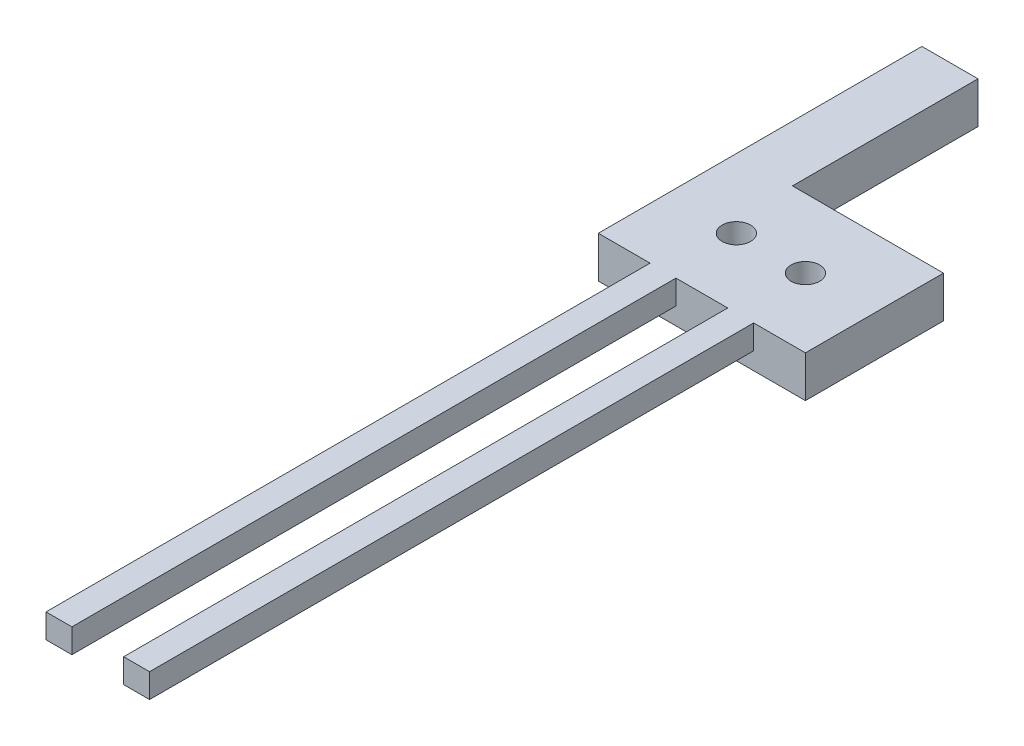
ISO-10303-21;
HEADER;
FILE_DESCRIPTION(('STEP AP214'),'2;1');
FILE_NAME('part.step','',(''),(''),'','','');
FILE_SCHEMA(('AUTOMOTIVE_DESIGN { 1 0 10303 214 1 1 1 1 }'));
ENDSEC;
DATA;
#1=APPLICATION_CONTEXT('core data for automotive mechanical design processes');
#2=APPLICATION_PROTOCOL_DEFINITION('international standard','automotive_design',2000,#1);
#3=PRODUCT_CONTEXT('',#1,'mechanical');
#4=PRODUCT('Part','Part','',(#3));
#5=PRODUCT_RELATED_PRODUCT_CATEGORY('part','',(#4));
#6=PRODUCT_DEFINITION_FORMATION('','',#4);
#7=PRODUCT_DEFINITION_CONTEXT('part definition',#1,'design');
#8=PRODUCT_DEFINITION('design','',#6,#7);
#9=PRODUCT_DEFINITION_SHAPE('','',#8);
#10=(LENGTH_UNIT() NAMED_UNIT(*) SI_UNIT(.MILLI.,.METRE.));
#11=(NAMED_UNIT(*) PLANE_ANGLE_UNIT() SI_UNIT($,.RADIAN.));
#12=(NAMED_UNIT(*) SI_UNIT($,.STERADIAN.) SOLID_ANGLE_UNIT());
#13=UNCERTAINTY_MEASURE_WITH_UNIT(LENGTH_MEASURE(1.E-05),#10,'distance_accuracy_value','');
#14=(GEOMETRIC_REPRESENTATION_CONTEXT(3) GLOBAL_UNCERTAINTY_ASSIGNED_CONTEXT((#13)) GLOBAL_UNIT_ASSIGNED_CONTEXT((#10,
#11,#12)) REPRESENTATION_CONTEXT('',''));
#15=CARTESIAN_POINT('',(0.,0.,0.));
#16=DIRECTION('',(0.,0.,1.));
#17=DIRECTION('',(1.,0.,0.));
#18=AXIS2_PLACEMENT_3D('',#15,#16,#17);
#19=CARTESIAN_POINT('',(0.,-4.8,0.));
#20=DIRECTION('',(0.,0.,-1.));
#21=DIRECTION('',(-1.,0.,0.));
#22=AXIS2_PLACEMENT_3D('',#19,#20,#21);
#23=PLANE('',#22);
#24=DIRECTION('',(0.,-1.,0.));
#25=VECTOR('',#24,1.);
#26=CARTESIAN_POINT('',(15.,0.,0.));
#27=LINE('',#26,#25);
#28=CARTESIAN_POINT('',(15.,0.,0.));
#29=VERTEX_POINT('',#28);
#30=CARTESIAN_POINT('',(15.,-2.8,0.));
#31=VERTEX_POINT('',#30);
#32=EDGE_CURVE('E206',#29,#31,#27,.T.);
#33=ORIENTED_EDGE('',*,*,#32,.F.);
#34=DIRECTION('',(-1.,0.,0.));
#35=VECTOR('',#34,1.);
#36=CARTESIAN_POINT('',(0.,0.,0.));
#37=LINE('',#36,#35);
#38=CARTESIAN_POINT('',(9.,0.,0.));
#39=VERTEX_POINT('',#38);
#40=EDGE_CURVE('E303',#29,#39,#37,.T.);
#41=ORIENTED_EDGE('',*,*,#40,.T.);
#42=DIRECTION('',(0.,1.,0.));
#43=VECTOR('',#42,1.);
#44=CARTESIAN_POINT('',(9.,0.,0.));
#45=LINE('',#44,#43);
#46=CARTESIAN_POINT('',(9.,-2.8,0.));
#47=VERTEX_POINT('',#46);
#48=EDGE_CURVE('E227',#47,#39,#45,.T.);
#49=ORIENTED_EDGE('',*,*,#48,.F.);
#50=DIRECTION('',(1.,0.,0.));
#51=VECTOR('',#50,1.);
#52=CARTESIAN_POINT('',(6.,-2.8,0.));
#53=LINE('',#52,#51);
#54=CARTESIAN_POINT('',(6.,-2.8,0.));
#55=VERTEX_POINT('',#54);
#56=EDGE_CURVE('E240',#55,#47,#53,.T.);
#57=ORIENTED_EDGE('',*,*,#56,.F.);
#58=DIRECTION('',(0.,-1.,0.));
#59=VECTOR('',#58,1.);
#60=CARTESIAN_POINT('',(6.,0.,0.));
#61=LINE('',#60,#59);
#62=CARTESIAN_POINT('',(6.,0.,0.));
#63=VERTEX_POINT('',#62);
#64=EDGE_CURVE('E210',#63,#55,#61,.T.);
#65=ORIENTED_EDGE('',*,*,#64,.F.);
#66=CARTESIAN_POINT('',(0.,0.,0.));
#67=VERTEX_POINT('',#66);
#68=EDGE_CURVE('E300',#63,#67,#37,.T.);
#69=ORIENTED_EDGE('',*,*,#68,.T.);
#70=DIRECTION('',(0.,1.,0.));
#71=VECTOR('',#70,1.);
#72=CARTESIAN_POINT('',(0.,-4.8,0.));
#73=LINE('',#72,#71);
#74=CARTESIAN_POINT('',(0.,-4.8,0.));
#75=VERTEX_POINT('',#74);
#76=EDGE_CURVE('E291',#75,#67,#73,.T.);
#77=ORIENTED_EDGE('',*,*,#76,.F.);
#78=DIRECTION('',(-1.,0.,0.));
#79=VECTOR('',#78,1.);
#80=CARTESIAN_POINT('',(0.,-4.8,0.));
#81=LINE('',#80,#79);
#82=CARTESIAN_POINT('',(24.,-4.8,0.));
#83=VERTEX_POINT('',#82);
#84=EDGE_CURVE('E288',#83,#75,#81,.T.);
#85=ORIENTED_EDGE('',*,*,#84,.F.);
#86=DIRECTION('',(0.,1.,0.));
#87=VECTOR('',#86,1.);
#88=CARTESIAN_POINT('',(24.,-4.8,0.));
#89=LINE('',#88,#87);
#90=CARTESIAN_POINT('',(24.,0.,0.));
#91=VERTEX_POINT('',#90);
#92=EDGE_CURVE('E54',#83,#91,#89,.T.);
#93=ORIENTED_EDGE('',*,*,#92,.T.);
#94=CARTESIAN_POINT('',(18.,0.,0.));
#95=VERTEX_POINT('',#94);
#96=EDGE_CURVE('E282',#91,#95,#37,.T.);
#97=ORIENTED_EDGE('',*,*,#96,.T.);
#98=DIRECTION('',(0.,1.,0.));
#99=VECTOR('',#98,1.);
#100=CARTESIAN_POINT('',(18.,0.,0.));
#101=LINE('',#100,#99);
#102=CARTESIAN_POINT('',(18.,-2.8,0.));
#103=VERTEX_POINT('',#102);
#104=EDGE_CURVE('E199',#103,#95,#101,.T.);
#105=ORIENTED_EDGE('',*,*,#104,.F.);
#106=DIRECTION('',(1.,0.,0.));
#107=VECTOR('',#106,1.);
#108=CARTESIAN_POINT('',(15.,-2.8,0.));
#109=LINE('',#108,#107);
#110=EDGE_CURVE('E69',#31,#103,#109,.T.);
#111=ORIENTED_EDGE('',*,*,#110,.F.);
#112=EDGE_LOOP('',(#33,#41,#49,#57,#65,#69,#77,#85,#93,#97,#105,#111));
#113=FACE_BOUND('',#112,.T.);
#114=ADVANCED_FACE('F45',(#113),#23,.F.);
#115=CARTESIAN_POINT('',(0.,-4.8,0.));
#116=DIRECTION('',(0.,-1.,0.));
#117=DIRECTION('',(0.,0.,-1.));
#118=AXIS2_PLACEMENT_3D('',#115,#116,#117);
#119=PLANE('',#118);
#120=CARTESIAN_POINT('',(8.,-4.8,-8.));
#121=DIRECTION('',(0.,-1.,0.));
#122=DIRECTION('',(0.,0.,-1.));
#123=AXIS2_PLACEMENT_3D('',#120,#121,#122);
#124=CIRCLE('',#123,1.65);
#125=CARTESIAN_POINT('',(8.,-4.8,-9.65));
#126=VERTEX_POINT('',#125);
#127=EDGE_CURVE('E271',#126,#126,#124,.T.);
#128=ORIENTED_EDGE('',*,*,#127,.F.);
#129=EDGE_LOOP('',(#128));
#130=FACE_BOUND('',#129,.T.);
#131=DIRECTION('',(0.,0.,-1.));
#132=VECTOR('',#131,1.);
#133=CARTESIAN_POINT('',(0.,-4.8,0.));
#134=LINE('',#133,#132);
#135=CARTESIAN_POINT('',(0.,-4.8,-37.5000000000065));
#136=VERTEX_POINT('',#135);
#137=EDGE_CURVE('E166',#75,#136,#134,.T.);
#138=ORIENTED_EDGE('',*,*,#137,.T.);
#139=DIRECTION('',(-1.,0.,0.));
#140=VECTOR('',#139,1.);
#141=CARTESIAN_POINT('',(6.49999999997977,-4.8,-37.5000000000065));
#142=LINE('',#141,#140);
#143=CARTESIAN_POINT('',(6.49999999997977,-4.8,-37.5000000000065));
#144=VERTEX_POINT('',#143);
#145=EDGE_CURVE('E152',#144,#136,#142,.T.);
#146=ORIENTED_EDGE('',*,*,#145,.F.);
#147=DIRECTION('',(0.,0.,-1.));
#148=VECTOR('',#147,1.);
#149=CARTESIAN_POINT('',(6.49999999997977,-4.8,-16.));
#150=LINE('',#149,#148);
#151=CARTESIAN_POINT('',(6.49999999997977,-4.8,-16.));
#152=VERTEX_POINT('',#151);
#153=EDGE_CURVE('E163',#152,#144,#150,.T.);
#154=ORIENTED_EDGE('',*,*,#153,.F.);
#155=DIRECTION('',(1.,0.,0.));
#156=VECTOR('',#155,1.);
#157=CARTESIAN_POINT('',(0.,-4.8,-16.));
#158=LINE('',#157,#156);
#159=CARTESIAN_POINT('',(24.,-4.8,-16.));
#160=VERTEX_POINT('',#159);
#161=EDGE_CURVE('E281',#152,#160,#158,.T.);
#162=ORIENTED_EDGE('',*,*,#161,.T.);
#163=DIRECTION('',(0.,0.,1.));
#164=VECTOR('',#163,1.);
#165=CARTESIAN_POINT('',(24.,-4.8,0.));
#166=LINE('',#165,#164);
#167=EDGE_CURVE('E285',#160,#83,#166,.T.);
#168=ORIENTED_EDGE('',*,*,#167,.T.);
#169=ORIENTED_EDGE('',*,*,#84,.T.);
#170=EDGE_LOOP('',(#138,#146,#154,#162,#168,#169));
#171=FACE_BOUND('',#170,.T.);
#172=CARTESIAN_POINT('',(16.,-4.8,-8.));
#173=DIRECTION('',(0.,-1.,0.));
#174=DIRECTION('',(0.,0.,-1.));
#175=AXIS2_PLACEMENT_3D('',#172,#173,#174);
#176=CIRCLE('',#175,1.65);
#177=CARTESIAN_POINT('',(16.,-4.8,-9.65));
#178=VERTEX_POINT('',#177);
#179=EDGE_CURVE('E263',#178,#178,#176,.T.);
#180=ORIENTED_EDGE('',*,*,#179,.F.);
#181=EDGE_LOOP('',(#180));
#182=FACE_BOUND('',#181,.T.);
#183=ADVANCED_FACE('F161',(#130,#171,#182),#119,.T.);
#184=CARTESIAN_POINT('',(0.,0.,0.));
#185=DIRECTION('',(0.,-1.,0.));
#186=DIRECTION('',(0.,0.,-1.));
#187=AXIS2_PLACEMENT_3D('',#184,#185,#186);
#188=PLANE('',#187);
#189=DIRECTION('',(0.,0.,-1.));
#190=VECTOR('',#189,1.);
#191=CARTESIAN_POINT('',(0.,0.,0.));
#192=LINE('',#191,#190);
#193=CARTESIAN_POINT('',(0.,0.,-37.5000000000065));
#194=VERTEX_POINT('',#193);
#195=EDGE_CURVE('E275',#67,#194,#192,.T.);
#196=ORIENTED_EDGE('',*,*,#195,.F.);
#197=ORIENTED_EDGE('',*,*,#68,.F.);
#198=DIRECTION('',(0.,0.,-1.));
#199=VECTOR('',#198,1.);
#200=CARTESIAN_POINT('',(6.,0.,70.));
#201=LINE('',#200,#199);
#202=CARTESIAN_POINT('',(6.,0.,70.));
#203=VERTEX_POINT('',#202);
#204=EDGE_CURVE('E236',#203,#63,#201,.T.);
#205=ORIENTED_EDGE('',*,*,#204,.F.);
#206=DIRECTION('',(-1.,0.,0.));
#207=VECTOR('',#206,1.);
#208=CARTESIAN_POINT('',(6.,0.,70.));
#209=LINE('',#208,#207);
#210=CARTESIAN_POINT('',(9.,0.,70.));
#211=VERTEX_POINT('',#210);
#212=EDGE_CURVE('E233',#211,#203,#209,.T.);
#213=ORIENTED_EDGE('',*,*,#212,.F.);
#214=DIRECTION('',(0.,0.,-1.));
#215=VECTOR('',#214,1.);
#216=CARTESIAN_POINT('',(9.,0.,70.));
#217=LINE('',#216,#215);
#218=EDGE_CURVE('E250',#211,#39,#217,.T.);
#219=ORIENTED_EDGE('',*,*,#218,.T.);
#220=ORIENTED_EDGE('',*,*,#40,.F.);
#221=DIRECTION('',(0.,0.,-1.));
#222=VECTOR('',#221,1.);
#223=CARTESIAN_POINT('',(15.,0.,70.));
#224=LINE('',#223,#222);
#225=CARTESIAN_POINT('',(15.,0.,70.));
#226=VERTEX_POINT('',#225);
#227=EDGE_CURVE('E194',#226,#29,#224,.T.);
#228=ORIENTED_EDGE('',*,*,#227,.F.);
#229=DIRECTION('',(-1.,0.,0.));
#230=VECTOR('',#229,1.);
#231=CARTESIAN_POINT('',(15.,0.,70.));
#232=LINE('',#231,#230);
#233=CARTESIAN_POINT('',(18.,0.,70.));
#234=VERTEX_POINT('',#233);
#235=EDGE_CURVE('E198',#234,#226,#232,.T.);
#236=ORIENTED_EDGE('',*,*,#235,.F.);
#237=DIRECTION('',(0.,0.,-1.));
#238=VECTOR('',#237,1.);
#239=CARTESIAN_POINT('',(18.,0.,70.));
#240=LINE('',#239,#238);
#241=EDGE_CURVE('E190',#234,#95,#240,.T.);
#242=ORIENTED_EDGE('',*,*,#241,.T.);
#243=ORIENTED_EDGE('',*,*,#96,.F.);
#244=DIRECTION('',(0.,0.,1.));
#245=VECTOR('',#244,1.);
#246=CARTESIAN_POINT('',(24.,0.,0.));
#247=LINE('',#246,#245);
#248=CARTESIAN_POINT('',(24.,0.,-16.));
#249=VERTEX_POINT('',#248);
#250=EDGE_CURVE('E297',#249,#91,#247,.T.);
#251=ORIENTED_EDGE('',*,*,#250,.F.);
#252=DIRECTION('',(1.,0.,0.));
#253=VECTOR('',#252,1.);
#254=CARTESIAN_POINT('',(0.,0.,-16.));
#255=LINE('',#254,#253);
#256=CARTESIAN_POINT('',(6.49999999997977,0.,-16.));
#257=VERTEX_POINT('',#256);
#258=EDGE_CURVE('E294',#257,#249,#255,.T.);
#259=ORIENTED_EDGE('',*,*,#258,.F.);
#260=DIRECTION('',(0.,0.,-1.));
#261=VECTOR('',#260,1.);
#262=CARTESIAN_POINT('',(6.49999999997977,0.,-16.));
#263=LINE('',#262,#261);
#264=CARTESIAN_POINT('',(6.49999999997977,0.,-37.5000000000065));
#265=VERTEX_POINT('',#264);
#266=EDGE_CURVE('E61',#257,#265,#263,.T.);
#267=ORIENTED_EDGE('',*,*,#266,.T.);
#268=DIRECTION('',(-1.,0.,0.));
#269=VECTOR('',#268,1.);
#270=CARTESIAN_POINT('',(6.49999999997977,0.,-37.5000000000065));
#271=LINE('',#270,#269);
#272=EDGE_CURVE('E154',#265,#194,#271,.T.);
#273=ORIENTED_EDGE('',*,*,#272,.T.);
#274=EDGE_LOOP('',(#196,#197,#205,#213,#219,#220,#228,#236,#242,#243,#251,#259,#267,#273));
#275=FACE_BOUND('',#274,.T.);
#276=CARTESIAN_POINT('',(8.,0.,-8.));
#277=DIRECTION('',(0.,-1.,0.));
#278=DIRECTION('',(0.,0.,-1.));
#279=AXIS2_PLACEMENT_3D('',#276,#277,#278);
#280=CIRCLE('',#279,1.65);
#281=CARTESIAN_POINT('',(8.,0.,-9.65));
#282=VERTEX_POINT('',#281);
#283=EDGE_CURVE('E267',#282,#282,#280,.T.);
#284=ORIENTED_EDGE('',*,*,#283,.T.);
#285=EDGE_LOOP('',(#284));
#286=FACE_BOUND('',#285,.T.);
#287=CARTESIAN_POINT('',(16.,0.,-8.));
#288=DIRECTION('',(0.,-1.,0.));
#289=DIRECTION('',(0.,0.,-1.));
#290=AXIS2_PLACEMENT_3D('',#287,#288,#289);
#291=CIRCLE('',#290,1.65);
#292=CARTESIAN_POINT('',(16.,0.,-9.65));
#293=VERTEX_POINT('',#292);
#294=EDGE_CURVE('E262',#293,#293,#291,.T.);
#295=ORIENTED_EDGE('',*,*,#294,.T.);
#296=EDGE_LOOP('',(#295));
#297=FACE_BOUND('',#296,.T.);
#298=ADVANCED_FACE('F317',(#275,#286,#297),#188,.F.);
#299=CARTESIAN_POINT('',(0.,-4.8,0.));
#300=DIRECTION('',(1.,0.,0.));
#301=DIRECTION('',(0.,0.,-1.));
#302=AXIS2_PLACEMENT_3D('',#299,#300,#301);
#303=PLANE('',#302);
#304=ORIENTED_EDGE('',*,*,#195,.T.);
#305=DIRECTION('',(0.,1.,0.));
#306=VECTOR('',#305,1.);
#307=CARTESIAN_POINT('',(0.,-4.8,-37.5000000000065));
#308=LINE('',#307,#306);
#309=EDGE_CURVE('E157',#136,#194,#308,.T.);
#310=ORIENTED_EDGE('',*,*,#309,.F.);
#311=ORIENTED_EDGE('',*,*,#137,.F.);
#312=ORIENTED_EDGE('',*,*,#76,.T.);
#313=EDGE_LOOP('',(#304,#310,#311,#312));
#314=FACE_BOUND('',#313,.T.);
#315=ADVANCED_FACE('F47',(#314),#303,.F.);
#316=CARTESIAN_POINT('',(0.,-4.8,-16.));
#317=DIRECTION('',(0.,0.,1.));
#318=DIRECTION('',(1.,0.,0.));
#319=AXIS2_PLACEMENT_3D('',#316,#317,#318);
#320=PLANE('',#319);
#321=ORIENTED_EDGE('',*,*,#161,.F.);
#322=DIRECTION('',(0.,1.,0.));
#323=VECTOR('',#322,1.);
#324=CARTESIAN_POINT('',(6.49999999997977,-4.8,-16.));
#325=LINE('',#324,#323);
#326=EDGE_CURVE('E171',#152,#257,#325,.T.);
#327=ORIENTED_EDGE('',*,*,#326,.T.);
#328=ORIENTED_EDGE('',*,*,#258,.T.);
#329=DIRECTION('',(0.,1.,0.));
#330=VECTOR('',#329,1.);
#331=CARTESIAN_POINT('',(24.,-4.8,-16.));
#332=LINE('',#331,#330);
#333=EDGE_CURVE('E11',#160,#249,#332,.T.);
#334=ORIENTED_EDGE('',*,*,#333,.F.);
#335=EDGE_LOOP('',(#321,#327,#328,#334));
#336=FACE_BOUND('',#335,.T.);
#337=ADVANCED_FACE('F373',(#336),#320,.F.);
#338=CARTESIAN_POINT('',(24.,-4.8,0.));
#339=DIRECTION('',(-1.,0.,0.));
#340=DIRECTION('',(0.,0.,1.));
#341=AXIS2_PLACEMENT_3D('',#338,#339,#340);
#342=PLANE('',#341);
#343=ORIENTED_EDGE('',*,*,#250,.T.);
#344=ORIENTED_EDGE('',*,*,#92,.F.);
#345=ORIENTED_EDGE('',*,*,#167,.F.);
#346=ORIENTED_EDGE('',*,*,#333,.T.);
#347=EDGE_LOOP('',(#343,#344,#345,#346));
#348=FACE_BOUND('',#347,.T.);
#349=ADVANCED_FACE('F371',(#348),#342,.F.);
#350=CARTESIAN_POINT('',(8.,-4.8,-8.));
#351=DIRECTION('',(0.,1.,0.));
#352=DIRECTION('',(0.,0.,1.));
#353=AXIS2_PLACEMENT_3D('',#350,#351,#352);
#354=CYLINDRICAL_SURFACE('',#353,1.65);
#355=ORIENTED_EDGE('',*,*,#127,.T.);
#356=EDGE_LOOP('',(#355));
#357=FACE_BOUND('',#356,.T.);
#358=ORIENTED_EDGE('',*,*,#283,.F.);
#359=EDGE_LOOP('',(#358));
#360=FACE_BOUND('',#359,.T.);
#361=ADVANCED_FACE('F360',(#357,#360),#354,.F.);
#362=CARTESIAN_POINT('',(16.,-4.8,-8.));
#363=DIRECTION('',(0.,1.,0.));
#364=DIRECTION('',(0.,0.,1.));
#365=AXIS2_PLACEMENT_3D('',#362,#363,#364);
#366=CYLINDRICAL_SURFACE('',#365,1.65);
#367=ORIENTED_EDGE('',*,*,#179,.T.);
#368=EDGE_LOOP('',(#367));
#369=FACE_BOUND('',#368,.T.);
#370=ORIENTED_EDGE('',*,*,#294,.F.);
#371=EDGE_LOOP('',(#370));
#372=FACE_BOUND('',#371,.T.);
#373=ADVANCED_FACE('F352',(#369,#372),#366,.F.);
#374=CARTESIAN_POINT('',(6.,0.,70.));
#375=DIRECTION('',(1.,0.,0.));
#376=DIRECTION('',(0.,0.,-1.));
#377=AXIS2_PLACEMENT_3D('',#374,#375,#376);
#378=PLANE('',#377);
#379=ORIENTED_EDGE('',*,*,#64,.T.);
#380=DIRECTION('',(0.,0.,-1.));
#381=VECTOR('',#380,1.);
#382=CARTESIAN_POINT('',(6.,-2.8,70.));
#383=LINE('',#382,#381);
#384=CARTESIAN_POINT('',(6.,-2.8,70.));
#385=VERTEX_POINT('',#384);
#386=EDGE_CURVE('E258',#385,#55,#383,.T.);
#387=ORIENTED_EDGE('',*,*,#386,.F.);
#388=DIRECTION('',(0.,-1.,0.));
#389=VECTOR('',#388,1.);
#390=CARTESIAN_POINT('',(6.,0.,70.));
#391=LINE('',#390,#389);
#392=EDGE_CURVE('E222',#203,#385,#391,.T.);
#393=ORIENTED_EDGE('',*,*,#392,.F.);
#394=ORIENTED_EDGE('',*,*,#204,.T.);
#395=EDGE_LOOP('',(#379,#387,#393,#394));
#396=FACE_BOUND('',#395,.T.);
#397=ADVANCED_FACE('F350',(#396),#378,.F.);
#398=CARTESIAN_POINT('',(6.,-2.8,70.));
#399=DIRECTION('',(0.,1.,0.));
#400=DIRECTION('',(0.,0.,1.));
#401=AXIS2_PLACEMENT_3D('',#398,#399,#400);
#402=PLANE('',#401);
#403=ORIENTED_EDGE('',*,*,#56,.T.);
#404=DIRECTION('',(0.,0.,-1.));
#405=VECTOR('',#404,1.);
#406=CARTESIAN_POINT('',(9.,-2.8,70.));
#407=LINE('',#406,#405);
#408=CARTESIAN_POINT('',(9.,-2.8,70.));
#409=VERTEX_POINT('',#408);
#410=EDGE_CURVE('E254',#409,#47,#407,.T.);
#411=ORIENTED_EDGE('',*,*,#410,.F.);
#412=DIRECTION('',(1.,0.,0.));
#413=VECTOR('',#412,1.);
#414=CARTESIAN_POINT('',(6.,-2.8,70.));
#415=LINE('',#414,#413);
#416=EDGE_CURVE('E226',#385,#409,#415,.T.);
#417=ORIENTED_EDGE('',*,*,#416,.F.);
#418=ORIENTED_EDGE('',*,*,#386,.T.);
#419=EDGE_LOOP('',(#403,#411,#417,#418));
#420=FACE_BOUND('',#419,.T.);
#421=ADVANCED_FACE('F347',(#420),#402,.F.);
#422=CARTESIAN_POINT('',(9.,0.,70.));
#423=DIRECTION('',(-1.,0.,0.));
#424=DIRECTION('',(0.,-1.,0.));
#425=AXIS2_PLACEMENT_3D('',#422,#423,#424);
#426=PLANE('',#425);
#427=ORIENTED_EDGE('',*,*,#48,.T.);
#428=ORIENTED_EDGE('',*,*,#218,.F.);
#429=DIRECTION('',(0.,1.,0.));
#430=VECTOR('',#429,1.);
#431=CARTESIAN_POINT('',(9.,0.,70.));
#432=LINE('',#431,#430);
#433=EDGE_CURVE('E230',#409,#211,#432,.T.);
#434=ORIENTED_EDGE('',*,*,#433,.F.);
#435=ORIENTED_EDGE('',*,*,#410,.T.);
#436=EDGE_LOOP('',(#427,#428,#434,#435));
#437=FACE_BOUND('',#436,.T.);
#438=ADVANCED_FACE('F336',(#437),#426,.F.);
#439=CARTESIAN_POINT('',(0.,0.,70.));
#440=DIRECTION('',(0.,0.,1.));
#441=DIRECTION('',(1.,0.,0.));
#442=AXIS2_PLACEMENT_3D('',#439,#440,#441);
#443=PLANE('',#442);
#444=ORIENTED_EDGE('',*,*,#392,.T.);
#445=ORIENTED_EDGE('',*,*,#416,.T.);
#446=ORIENTED_EDGE('',*,*,#433,.T.);
#447=ORIENTED_EDGE('',*,*,#212,.T.);
#448=EDGE_LOOP('',(#444,#445,#446,#447));
#449=FACE_BOUND('',#448,.T.);
#450=ADVANCED_FACE('F344',(#449),#443,.T.);
#451=CARTESIAN_POINT('',(15.,0.,70.));
#452=DIRECTION('',(1.,0.,0.));
#453=DIRECTION('',(0.,1.,0.));
#454=AXIS2_PLACEMENT_3D('',#451,#452,#453);
#455=PLANE('',#454);
#456=ORIENTED_EDGE('',*,*,#32,.T.);
#457=DIRECTION('',(0.,0.,-1.));
#458=VECTOR('',#457,1.);
#459=CARTESIAN_POINT('',(15.,-2.8,70.));
#460=LINE('',#459,#458);
#461=CARTESIAN_POINT('',(15.,-2.8,70.));
#462=VERTEX_POINT('',#461);
#463=EDGE_CURVE('E181',#462,#31,#460,.T.);
#464=ORIENTED_EDGE('',*,*,#463,.F.);
#465=DIRECTION('',(0.,-1.,0.));
#466=VECTOR('',#465,1.);
#467=CARTESIAN_POINT('',(15.,0.,70.));
#468=LINE('',#467,#466);
#469=EDGE_CURVE('E203',#226,#462,#468,.T.);
#470=ORIENTED_EDGE('',*,*,#469,.F.);
#471=ORIENTED_EDGE('',*,*,#227,.T.);
#472=EDGE_LOOP('',(#456,#464,#470,#471));
#473=FACE_BOUND('',#472,.T.);
#474=ADVANCED_FACE('F332',(#473),#455,.F.);
#475=CARTESIAN_POINT('',(15.,-2.8,70.));
#476=DIRECTION('',(0.,1.,0.));
#477=DIRECTION('',(0.,0.,1.));
#478=AXIS2_PLACEMENT_3D('',#475,#476,#477);
#479=PLANE('',#478);
#480=ORIENTED_EDGE('',*,*,#110,.T.);
#481=DIRECTION('',(0.,0.,-1.));
#482=VECTOR('',#481,1.);
#483=CARTESIAN_POINT('',(18.,-2.8,70.));
#484=LINE('',#483,#482);
#485=CARTESIAN_POINT('',(18.,-2.8,70.));
#486=VERTEX_POINT('',#485);
#487=EDGE_CURVE('E186',#486,#103,#484,.T.);
#488=ORIENTED_EDGE('',*,*,#487,.F.);
#489=DIRECTION('',(1.,0.,0.));
#490=VECTOR('',#489,1.);
#491=CARTESIAN_POINT('',(15.,-2.8,70.));
#492=LINE('',#491,#490);
#493=EDGE_CURVE('E216',#462,#486,#492,.T.);
#494=ORIENTED_EDGE('',*,*,#493,.F.);
#495=ORIENTED_EDGE('',*,*,#463,.T.);
#496=EDGE_LOOP('',(#480,#488,#494,#495));
#497=FACE_BOUND('',#496,.T.);
#498=ADVANCED_FACE('F328',(#497),#479,.F.);
#499=CARTESIAN_POINT('',(18.,0.,70.));
#500=DIRECTION('',(-1.,0.,0.));
#501=DIRECTION('',(0.,-1.,0.));
#502=AXIS2_PLACEMENT_3D('',#499,#500,#501);
#503=PLANE('',#502);
#504=ORIENTED_EDGE('',*,*,#104,.T.);
#505=ORIENTED_EDGE('',*,*,#241,.F.);
#506=DIRECTION('',(0.,1.,0.));
#507=VECTOR('',#506,1.);
#508=CARTESIAN_POINT('',(18.,0.,70.));
#509=LINE('',#508,#507);
#510=EDGE_CURVE('E213',#486,#234,#509,.T.);
#511=ORIENTED_EDGE('',*,*,#510,.F.);
#512=ORIENTED_EDGE('',*,*,#487,.T.);
#513=EDGE_LOOP('',(#504,#505,#511,#512));
#514=FACE_BOUND('',#513,.T.);
#515=ADVANCED_FACE('F325',(#514),#503,.F.);
#516=CARTESIAN_POINT('',(0.,0.,70.));
#517=DIRECTION('',(0.,0.,1.));
#518=DIRECTION('',(1.,0.,0.));
#519=AXIS2_PLACEMENT_3D('',#516,#517,#518);
#520=PLANE('',#519);
#521=ORIENTED_EDGE('',*,*,#469,.T.);
#522=ORIENTED_EDGE('',*,*,#493,.T.);
#523=ORIENTED_EDGE('',*,*,#510,.T.);
#524=ORIENTED_EDGE('',*,*,#235,.T.);
#525=EDGE_LOOP('',(#521,#522,#523,#524));
#526=FACE_BOUND('',#525,.T.);
#527=ADVANCED_FACE('F397',(#526),#520,.T.);
#528=CARTESIAN_POINT('',(6.49999999997977,-4.8,-16.));
#529=DIRECTION('',(1.,0.,0.));
#530=DIRECTION('',(0.,0.,-1.));
#531=AXIS2_PLACEMENT_3D('',#528,#529,#530);
#532=PLANE('',#531);
#533=ORIENTED_EDGE('',*,*,#266,.F.);
#534=ORIENTED_EDGE('',*,*,#326,.F.);
#535=ORIENTED_EDGE('',*,*,#153,.T.);
#536=DIRECTION('',(0.,1.,0.));
#537=VECTOR('',#536,1.);
#538=CARTESIAN_POINT('',(6.49999999997977,-4.8,-37.5000000000065));
#539=LINE('',#538,#537);
#540=EDGE_CURVE('E148',#144,#265,#539,.T.);
#541=ORIENTED_EDGE('',*,*,#540,.T.);
#542=EDGE_LOOP('',(#533,#534,#535,#541));
#543=FACE_BOUND('',#542,.T.);
#544=ADVANCED_FACE('F170',(#543),#532,.T.);
#545=CARTESIAN_POINT('',(6.49999999997977,-4.8,-37.5000000000065));
#546=DIRECTION('',(0.,0.,-1.));
#547=DIRECTION('',(-1.,0.,0.));
#548=AXIS2_PLACEMENT_3D('',#545,#546,#547);
#549=PLANE('',#548);
#550=ORIENTED_EDGE('',*,*,#272,.F.);
#551=ORIENTED_EDGE('',*,*,#540,.F.);
#552=ORIENTED_EDGE('',*,*,#145,.T.);
#553=ORIENTED_EDGE('',*,*,#309,.T.);
#554=EDGE_LOOP('',(#550,#551,#552,#553));
#555=FACE_BOUND('',#554,.T.);
#556=ADVANCED_FACE('F150',(#555),#549,.T.);
#557=CLOSED_SHELL('',(#114,#183,#298,#315,#337,#349,#361,#373,#397,#421,#438,#450,#474,#498,
#515,#527,#544,#556));
#558=MANIFOLD_SOLID_BREP('B2',#557);
#559=ADVANCED_BREP_SHAPE_REPRESENTATION('',(#18,#558),#14);
#560=SHAPE_DEFINITION_REPRESENTATION(#9,#559);
ENDSEC;
END-ISO-10303-21;
